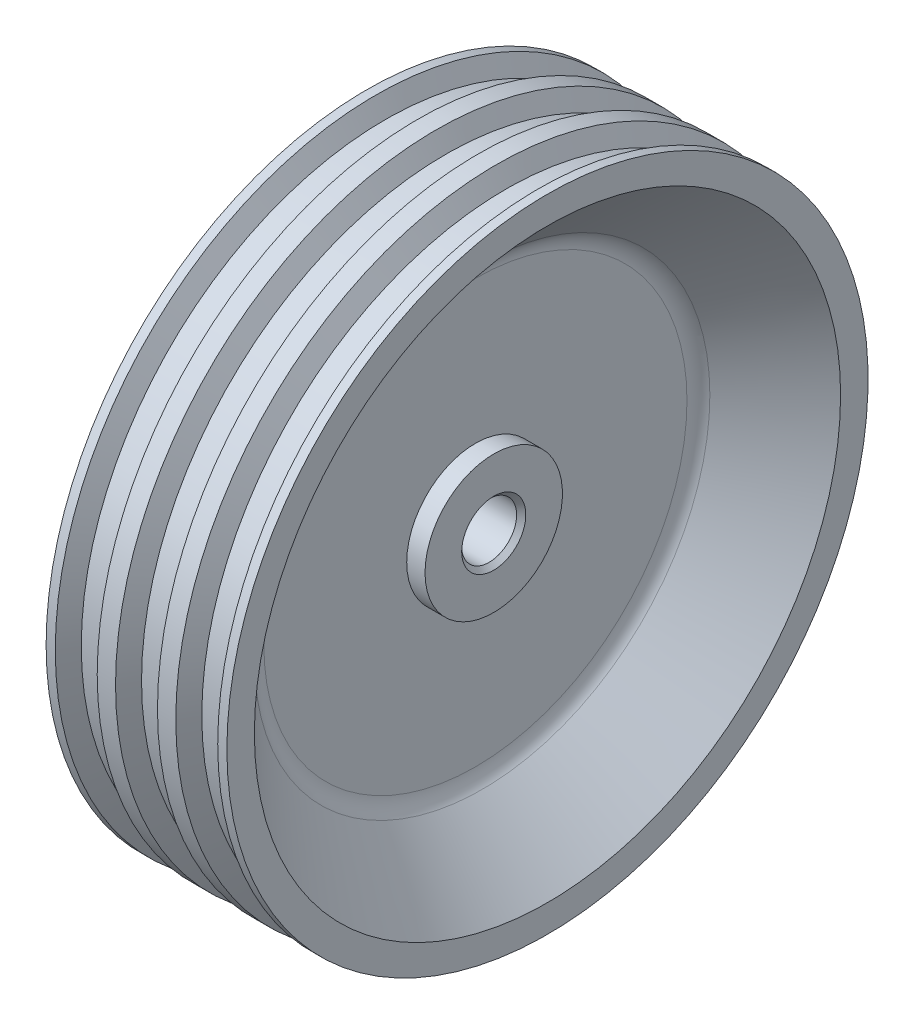
ISO-10303-21;
HEADER;
FILE_DESCRIPTION(('STEP AP214'),'2;1');
FILE_NAME('part.step','',(''),(''),'','','');
FILE_SCHEMA(('AUTOMOTIVE_DESIGN { 1 0 10303 214 1 1 1 1 }'));
ENDSEC;
DATA;
#1=APPLICATION_CONTEXT('core data for automotive mechanical design processes');
#2=APPLICATION_PROTOCOL_DEFINITION('international standard','automotive_design',2000,#1);
#3=PRODUCT_CONTEXT('',#1,'mechanical');
#4=PRODUCT('Part','Part','',(#3));
#5=PRODUCT_RELATED_PRODUCT_CATEGORY('part','',(#4));
#6=PRODUCT_DEFINITION_FORMATION('','',#4);
#7=PRODUCT_DEFINITION_CONTEXT('part definition',#1,'design');
#8=PRODUCT_DEFINITION('design','',#6,#7);
#9=PRODUCT_DEFINITION_SHAPE('','',#8);
#10=(LENGTH_UNIT() NAMED_UNIT(*) SI_UNIT(.MILLI.,.METRE.));
#11=(NAMED_UNIT(*) PLANE_ANGLE_UNIT() SI_UNIT($,.RADIAN.));
#12=(NAMED_UNIT(*) SI_UNIT($,.STERADIAN.) SOLID_ANGLE_UNIT());
#13=UNCERTAINTY_MEASURE_WITH_UNIT(LENGTH_MEASURE(1.E-05),#10,'distance_accuracy_value','');
#14=(GEOMETRIC_REPRESENTATION_CONTEXT(3) GLOBAL_UNCERTAINTY_ASSIGNED_CONTEXT((#13)) GLOBAL_UNIT_ASSIGNED_CONTEXT((#10,
#11,#12)) REPRESENTATION_CONTEXT('',''));
#15=CARTESIAN_POINT('',(0.,0.,0.));
#16=DIRECTION('',(0.,0.,1.));
#17=DIRECTION('',(1.,0.,0.));
#18=AXIS2_PLACEMENT_3D('',#15,#16,#17);
#19=CARTESIAN_POINT('',(8.,0.,0.));
#20=DIRECTION('',(-1.,0.,0.));
#21=DIRECTION('',(0.,0.,0.999999999999999));
#22=AXIS2_PLACEMENT_3D('',#19,#20,#21);
#23=PLANE('',#22);
#24=CARTESIAN_POINT('',(8.,0.,0.));
#25=DIRECTION('',(-1.,0.,0.));
#26=DIRECTION('',(0.,0.,0.999999999999999));
#27=AXIS2_PLACEMENT_3D('',#24,#25,#26);
#28=CIRCLE('',#27,7.00000000000001);
#29=CARTESIAN_POINT('',(8.,0.,7.));
#30=VERTEX_POINT('',#29);
#31=EDGE_CURVE('E12',#30,#30,#28,.T.);
#32=ORIENTED_EDGE('',*,*,#31,.T.);
#33=EDGE_LOOP('',(#32));
#34=FACE_BOUND('',#33,.T.);
#35=CARTESIAN_POINT('',(8.,0.,0.));
#36=DIRECTION('',(-1.,0.,0.));
#37=DIRECTION('',(0.,0.,0.999999999999999));
#38=AXIS2_PLACEMENT_3D('',#35,#36,#37);
#39=CIRCLE('',#38,15.);
#40=CARTESIAN_POINT('',(8.,0.,15.));
#41=VERTEX_POINT('',#40);
#42=EDGE_CURVE('E96',#41,#41,#39,.T.);
#43=ORIENTED_EDGE('',*,*,#42,.F.);
#44=EDGE_LOOP('',(#43));
#45=FACE_BOUND('',#44,.T.);
#46=ADVANCED_FACE('F55',(#34,#45),#23,.F.);
#47=CARTESIAN_POINT('',(-13.7579676272889,0.,0.));
#48=DIRECTION('',(-1.,0.,0.));
#49=DIRECTION('',(0.,0.,0.999999999999999));
#50=AXIS2_PLACEMENT_3D('',#47,#48,#49);
#51=CYLINDRICAL_SURFACE('',#50,15.);
#52=CARTESIAN_POINT('',(4.,0.,0.));
#53=DIRECTION('',(-1.,0.,0.));
#54=DIRECTION('',(0.,0.,0.999999999999999));
#55=AXIS2_PLACEMENT_3D('',#52,#53,#54);
#56=CIRCLE('',#55,15.);
#57=CARTESIAN_POINT('',(4.,0.,15.));
#58=VERTEX_POINT('',#57);
#59=EDGE_CURVE('E100',#58,#58,#56,.T.);
#60=ORIENTED_EDGE('',*,*,#59,.F.);
#61=EDGE_LOOP('',(#60));
#62=FACE_BOUND('',#61,.T.);
#63=ORIENTED_EDGE('',*,*,#42,.T.);
#64=EDGE_LOOP('',(#63));
#65=FACE_BOUND('',#64,.T.);
#66=ADVANCED_FACE('F197',(#62,#65),#51,.T.);
#67=CARTESIAN_POINT('',(4.,0.,-15.));
#68=DIRECTION('',(-1.,0.,0.));
#69=DIRECTION('',(0.,0.,0.999999999999999));
#70=AXIS2_PLACEMENT_3D('',#67,#68,#69);
#71=PLANE('',#70);
#72=CARTESIAN_POINT('',(4.,0.,0.));
#73=DIRECTION('',(-1.,0.,0.));
#74=DIRECTION('',(0.,0.,0.999999999999999));
#75=AXIS2_PLACEMENT_3D('',#72,#73,#74);
#76=CIRCLE('',#75,46.1935492808865);
#77=CARTESIAN_POINT('',(4.,0.,46.1935492808865));
#78=VERTEX_POINT('',#77);
#79=EDGE_CURVE('E88',#78,#78,#76,.F.);
#80=ORIENTED_EDGE('',*,*,#79,.T.);
#81=EDGE_LOOP('',(#80));
#82=FACE_BOUND('',#81,.T.);
#83=ORIENTED_EDGE('',*,*,#59,.T.);
#84=EDGE_LOOP('',(#83));
#85=FACE_BOUND('',#84,.T.);
#86=ADVANCED_FACE('F202',(#82,#85),#71,.F.);
#87=CARTESIAN_POINT('',(4.,0.,0.));
#88=DIRECTION('',(1.,0.,0.));
#89=DIRECTION('',(0.,0.,-0.999999999999999));
#90=AXIS2_PLACEMENT_3D('',#87,#88,#89);
#91=CONICAL_SURFACE('',#90,48.264617092752,0.785398163397451);
#92=CARTESIAN_POINT('',(5.46446609406725,0.,0.));
#93=DIRECTION('',(1.,0.,0.));
#94=DIRECTION('',(0.,0.,-0.999999999999999));
#95=AXIS2_PLACEMENT_3D('',#92,#93,#94);
#96=CIRCLE('',#95,49.7290831868192);
#97=CARTESIAN_POINT('',(5.46446609406725,0.,-49.7290831868192));
#98=VERTEX_POINT('',#97);
#99=EDGE_CURVE('E92',#98,#98,#96,.F.);
#100=ORIENTED_EDGE('',*,*,#99,.T.);
#101=EDGE_LOOP('',(#100));
#102=FACE_BOUND('',#101,.T.);
#103=CARTESIAN_POINT('',(19.735382907248,0.,0.));
#104=DIRECTION('',(-1.,0.,0.));
#105=DIRECTION('',(0.,0.,0.999999999999999));
#106=AXIS2_PLACEMENT_3D('',#103,#104,#105);
#107=CIRCLE('',#106,64.);
#108=CARTESIAN_POINT('',(19.735382907248,0.,64.));
#109=VERTEX_POINT('',#108);
#110=EDGE_CURVE('E104',#109,#109,#107,.T.);
#111=ORIENTED_EDGE('',*,*,#110,.F.);
#112=EDGE_LOOP('',(#111));
#113=FACE_BOUND('',#112,.T.);
#114=ADVANCED_FACE('F385',(#102,#113),#91,.F.);
#115=CARTESIAN_POINT('',(19.735382907248,0.,-64.));
#116=DIRECTION('',(-1.,0.,0.));
#117=DIRECTION('',(0.,0.,0.999999999999999));
#118=AXIS2_PLACEMENT_3D('',#115,#116,#117);
#119=PLANE('',#118);
#120=CARTESIAN_POINT('',(19.735382907248,0.,0.));
#121=DIRECTION('',(-1.,0.,0.));
#122=DIRECTION('',(0.,0.,0.999999999999999));
#123=AXIS2_PLACEMENT_3D('',#120,#121,#122);
#124=CIRCLE('',#123,70.);
#125=CARTESIAN_POINT('',(19.735382907248,0.,70.));
#126=VERTEX_POINT('',#125);
#127=EDGE_CURVE('E108',#126,#126,#124,.T.);
#128=ORIENTED_EDGE('',*,*,#127,.F.);
#129=EDGE_LOOP('',(#128));
#130=FACE_BOUND('',#129,.T.);
#131=ORIENTED_EDGE('',*,*,#110,.T.);
#132=EDGE_LOOP('',(#131));
#133=FACE_BOUND('',#132,.T.);
#134=ADVANCED_FACE('F377',(#130,#133),#119,.F.);
#135=CARTESIAN_POINT('',(-13.7579676272889,0.,0.));
#136=DIRECTION('',(-1.,0.,0.));
#137=DIRECTION('',(0.,0.,0.999999999999999));
#138=AXIS2_PLACEMENT_3D('',#135,#136,#137);
#139=CYLINDRICAL_SURFACE('',#138,70.);
#140=CARTESIAN_POINT('',(17.735382907248,0.,0.));
#141=DIRECTION('',(-1.,0.,0.));
#142=DIRECTION('',(0.,0.,0.999999999999999));
#143=AXIS2_PLACEMENT_3D('',#140,#141,#142);
#144=CIRCLE('',#143,70.);
#145=CARTESIAN_POINT('',(17.735382907248,0.,70.));
#146=VERTEX_POINT('',#145);
#147=EDGE_CURVE('E112',#146,#146,#144,.T.);
#148=ORIENTED_EDGE('',*,*,#147,.F.);
#149=EDGE_LOOP('',(#148));
#150=FACE_BOUND('',#149,.T.);
#151=ORIENTED_EDGE('',*,*,#127,.T.);
#152=EDGE_LOOP('',(#151));
#153=FACE_BOUND('',#152,.T.);
#154=ADVANCED_FACE('F369',(#150,#153),#139,.T.);
#155=CARTESIAN_POINT('',(17.735382907248,0.,0.));
#156=DIRECTION('',(1.,0.,0.));
#157=DIRECTION('',(0.,0.,-0.999999999999999));
#158=AXIS2_PLACEMENT_3D('',#155,#156,#157);
#159=CONICAL_SURFACE('',#158,70.,1.0471975511966);
#160=CARTESIAN_POINT('',(15.6569219381653,0.,0.));
#161=DIRECTION('',(-1.,0.,0.));
#162=DIRECTION('',(0.,0.,0.999999999999999));
#163=AXIS2_PLACEMENT_3D('',#160,#161,#162);
#164=CIRCLE('',#163,66.4);
#165=CARTESIAN_POINT('',(15.6569219381653,0.,66.4));
#166=VERTEX_POINT('',#165);
#167=EDGE_CURVE('E116',#166,#166,#164,.T.);
#168=ORIENTED_EDGE('',*,*,#167,.F.);
#169=EDGE_LOOP('',(#168));
#170=FACE_BOUND('',#169,.T.);
#171=ORIENTED_EDGE('',*,*,#147,.T.);
#172=EDGE_LOOP('',(#171));
#173=FACE_BOUND('',#172,.T.);
#174=ADVANCED_FACE('F361',(#170,#173),#159,.T.);
#175=CARTESIAN_POINT('',(-13.7579676272889,0.,0.));
#176=DIRECTION('',(-1.,0.,0.));
#177=DIRECTION('',(0.,0.,0.999999999999999));
#178=AXIS2_PLACEMENT_3D('',#175,#176,#177);
#179=CYLINDRICAL_SURFACE('',#178,66.4);
#180=CARTESIAN_POINT('',(10.6569219381653,0.,0.));
#181=DIRECTION('',(-1.,0.,0.));
#182=DIRECTION('',(0.,0.,0.999999999999999));
#183=AXIS2_PLACEMENT_3D('',#180,#181,#182);
#184=CIRCLE('',#183,66.4);
#185=CARTESIAN_POINT('',(10.6569219381653,0.,66.4));
#186=VERTEX_POINT('',#185);
#187=EDGE_CURVE('E120',#186,#186,#184,.T.);
#188=ORIENTED_EDGE('',*,*,#187,.F.);
#189=EDGE_LOOP('',(#188));
#190=FACE_BOUND('',#189,.T.);
#191=ORIENTED_EDGE('',*,*,#167,.T.);
#192=EDGE_LOOP('',(#191));
#193=FACE_BOUND('',#192,.T.);
#194=ADVANCED_FACE('F353',(#190,#193),#179,.T.);
#195=CARTESIAN_POINT('',(10.6569219381653,0.,0.));
#196=DIRECTION('',(-1.,0.,0.));
#197=DIRECTION('',(0.,0.,0.999999999999999));
#198=AXIS2_PLACEMENT_3D('',#195,#196,#197);
#199=CONICAL_SURFACE('',#198,66.4,1.0471975511966);
#200=CARTESIAN_POINT('',(8.57846096908266,0.,0.));
#201=DIRECTION('',(-1.,0.,0.));
#202=DIRECTION('',(0.,0.,0.999999999999999));
#203=AXIS2_PLACEMENT_3D('',#200,#201,#202);
#204=CIRCLE('',#203,70.);
#205=CARTESIAN_POINT('',(8.57846096908266,0.,70.));
#206=VERTEX_POINT('',#205);
#207=EDGE_CURVE('E124',#206,#206,#204,.T.);
#208=ORIENTED_EDGE('',*,*,#207,.F.);
#209=EDGE_LOOP('',(#208));
#210=FACE_BOUND('',#209,.T.);
#211=ORIENTED_EDGE('',*,*,#187,.T.);
#212=EDGE_LOOP('',(#211));
#213=FACE_BOUND('',#212,.T.);
#214=ADVANCED_FACE('F345',(#210,#213),#199,.T.);
#215=CARTESIAN_POINT('',(-13.7579676272889,0.,0.));
#216=DIRECTION('',(-1.,0.,0.));
#217=DIRECTION('',(0.,0.,0.999999999999999));
#218=AXIS2_PLACEMENT_3D('',#215,#216,#217);
#219=CYLINDRICAL_SURFACE('',#218,70.);
#220=CARTESIAN_POINT('',(4.57846096908265,0.,0.));
#221=DIRECTION('',(-1.,0.,0.));
#222=DIRECTION('',(0.,0.,0.999999999999999));
#223=AXIS2_PLACEMENT_3D('',#220,#221,#222);
#224=CIRCLE('',#223,70.);
#225=CARTESIAN_POINT('',(4.57846096908265,0.,70.));
#226=VERTEX_POINT('',#225);
#227=EDGE_CURVE('E128',#226,#226,#224,.T.);
#228=ORIENTED_EDGE('',*,*,#227,.F.);
#229=EDGE_LOOP('',(#228));
#230=FACE_BOUND('',#229,.T.);
#231=ORIENTED_EDGE('',*,*,#207,.T.);
#232=EDGE_LOOP('',(#231));
#233=FACE_BOUND('',#232,.T.);
#234=ADVANCED_FACE('F337',(#230,#233),#219,.T.);
#235=CARTESIAN_POINT('',(4.57846096908265,0.,0.));
#236=DIRECTION('',(1.,0.,0.));
#237=DIRECTION('',(0.,0.,-0.999999999999999));
#238=AXIS2_PLACEMENT_3D('',#235,#236,#237);
#239=CONICAL_SURFACE('',#238,70.,1.0471975511966);
#240=CARTESIAN_POINT('',(2.5,0.,0.));
#241=DIRECTION('',(-1.,0.,0.));
#242=DIRECTION('',(0.,0.,0.999999999999999));
#243=AXIS2_PLACEMENT_3D('',#240,#241,#242);
#244=CIRCLE('',#243,66.4);
#245=CARTESIAN_POINT('',(2.5,0.,66.4));
#246=VERTEX_POINT('',#245);
#247=EDGE_CURVE('E132',#246,#246,#244,.T.);
#248=ORIENTED_EDGE('',*,*,#247,.F.);
#249=EDGE_LOOP('',(#248));
#250=FACE_BOUND('',#249,.T.);
#251=ORIENTED_EDGE('',*,*,#227,.T.);
#252=EDGE_LOOP('',(#251));
#253=FACE_BOUND('',#252,.T.);
#254=ADVANCED_FACE('F329',(#250,#253),#239,.T.);
#255=CARTESIAN_POINT('',(-13.7579676272889,0.,0.));
#256=DIRECTION('',(-1.,0.,0.));
#257=DIRECTION('',(0.,0.,0.999999999999999));
#258=AXIS2_PLACEMENT_3D('',#255,#256,#257);
#259=CYLINDRICAL_SURFACE('',#258,66.4);
#260=CARTESIAN_POINT('',(-2.5,0.,0.));
#261=DIRECTION('',(-1.,0.,0.));
#262=DIRECTION('',(0.,0.,0.999999999999999));
#263=AXIS2_PLACEMENT_3D('',#260,#261,#262);
#264=CIRCLE('',#263,66.4);
#265=CARTESIAN_POINT('',(-2.5,0.,66.4));
#266=VERTEX_POINT('',#265);
#267=EDGE_CURVE('E136',#266,#266,#264,.T.);
#268=ORIENTED_EDGE('',*,*,#267,.F.);
#269=EDGE_LOOP('',(#268));
#270=FACE_BOUND('',#269,.T.);
#271=ORIENTED_EDGE('',*,*,#247,.T.);
#272=EDGE_LOOP('',(#271));
#273=FACE_BOUND('',#272,.T.);
#274=ADVANCED_FACE('F321',(#270,#273),#259,.T.);
#275=CARTESIAN_POINT('',(-2.5,0.,0.));
#276=DIRECTION('',(-1.,0.,0.));
#277=DIRECTION('',(0.,0.,0.999999999999999));
#278=AXIS2_PLACEMENT_3D('',#275,#276,#277);
#279=CONICAL_SURFACE('',#278,66.4,1.0471975511966);
#280=CARTESIAN_POINT('',(-4.57846096908265,0.,0.));
#281=DIRECTION('',(-1.,0.,0.));
#282=DIRECTION('',(0.,0.,0.999999999999999));
#283=AXIS2_PLACEMENT_3D('',#280,#281,#282);
#284=CIRCLE('',#283,70.);
#285=CARTESIAN_POINT('',(-4.57846096908265,0.,70.));
#286=VERTEX_POINT('',#285);
#287=EDGE_CURVE('E140',#286,#286,#284,.T.);
#288=ORIENTED_EDGE('',*,*,#287,.F.);
#289=EDGE_LOOP('',(#288));
#290=FACE_BOUND('',#289,.T.);
#291=ORIENTED_EDGE('',*,*,#267,.T.);
#292=EDGE_LOOP('',(#291));
#293=FACE_BOUND('',#292,.T.);
#294=ADVANCED_FACE('F313',(#290,#293),#279,.T.);
#295=CARTESIAN_POINT('',(-13.7579676272889,0.,0.));
#296=DIRECTION('',(-1.,0.,0.));
#297=DIRECTION('',(0.,0.,0.999999999999999));
#298=AXIS2_PLACEMENT_3D('',#295,#296,#297);
#299=CYLINDRICAL_SURFACE('',#298,70.);
#300=CARTESIAN_POINT('',(-8.57846096908266,0.,0.));
#301=DIRECTION('',(-1.,0.,0.));
#302=DIRECTION('',(0.,0.,0.999999999999999));
#303=AXIS2_PLACEMENT_3D('',#300,#301,#302);
#304=CIRCLE('',#303,70.);
#305=CARTESIAN_POINT('',(-8.57846096908266,0.,70.));
#306=VERTEX_POINT('',#305);
#307=EDGE_CURVE('E144',#306,#306,#304,.T.);
#308=ORIENTED_EDGE('',*,*,#307,.F.);
#309=EDGE_LOOP('',(#308));
#310=FACE_BOUND('',#309,.T.);
#311=ORIENTED_EDGE('',*,*,#287,.T.);
#312=EDGE_LOOP('',(#311));
#313=FACE_BOUND('',#312,.T.);
#314=ADVANCED_FACE('F305',(#310,#313),#299,.T.);
#315=CARTESIAN_POINT('',(-8.57846096908266,0.,0.));
#316=DIRECTION('',(1.,0.,0.));
#317=DIRECTION('',(0.,0.,-0.999999999999999));
#318=AXIS2_PLACEMENT_3D('',#315,#316,#317);
#319=CONICAL_SURFACE('',#318,70.,1.0471975511966);
#320=CARTESIAN_POINT('',(-10.6569219381653,0.,0.));
#321=DIRECTION('',(-1.,0.,0.));
#322=DIRECTION('',(0.,0.,0.999999999999999));
#323=AXIS2_PLACEMENT_3D('',#320,#321,#322);
#324=CIRCLE('',#323,66.4);
#325=CARTESIAN_POINT('',(-10.6569219381653,0.,66.4));
#326=VERTEX_POINT('',#325);
#327=EDGE_CURVE('E148',#326,#326,#324,.T.);
#328=ORIENTED_EDGE('',*,*,#327,.F.);
#329=EDGE_LOOP('',(#328));
#330=FACE_BOUND('',#329,.T.);
#331=ORIENTED_EDGE('',*,*,#307,.T.);
#332=EDGE_LOOP('',(#331));
#333=FACE_BOUND('',#332,.T.);
#334=ADVANCED_FACE('F297',(#330,#333),#319,.T.);
#335=CARTESIAN_POINT('',(-13.7579676272889,0.,0.));
#336=DIRECTION('',(-1.,0.,0.));
#337=DIRECTION('',(0.,0.,0.999999999999999));
#338=AXIS2_PLACEMENT_3D('',#335,#336,#337);
#339=CYLINDRICAL_SURFACE('',#338,66.4);
#340=CARTESIAN_POINT('',(-15.6569219381653,0.,0.));
#341=DIRECTION('',(-1.,0.,0.));
#342=DIRECTION('',(0.,0.,0.999999999999999));
#343=AXIS2_PLACEMENT_3D('',#340,#341,#342);
#344=CIRCLE('',#343,66.4);
#345=CARTESIAN_POINT('',(-15.6569219381653,0.,66.4));
#346=VERTEX_POINT('',#345);
#347=EDGE_CURVE('E152',#346,#346,#344,.T.);
#348=ORIENTED_EDGE('',*,*,#347,.F.);
#349=EDGE_LOOP('',(#348));
#350=FACE_BOUND('',#349,.T.);
#351=ORIENTED_EDGE('',*,*,#327,.T.);
#352=EDGE_LOOP('',(#351));
#353=FACE_BOUND('',#352,.T.);
#354=ADVANCED_FACE('F289',(#350,#353),#339,.T.);
#355=CARTESIAN_POINT('',(-15.6569219381653,0.,0.));
#356=DIRECTION('',(-1.,0.,0.));
#357=DIRECTION('',(0.,0.,0.999999999999999));
#358=AXIS2_PLACEMENT_3D('',#355,#356,#357);
#359=CONICAL_SURFACE('',#358,66.4,1.0471975511966);
#360=CARTESIAN_POINT('',(-17.735382907248,0.,0.));
#361=DIRECTION('',(-1.,0.,0.));
#362=DIRECTION('',(0.,0.,0.999999999999999));
#363=AXIS2_PLACEMENT_3D('',#360,#361,#362);
#364=CIRCLE('',#363,70.);
#365=CARTESIAN_POINT('',(-17.735382907248,0.,70.));
#366=VERTEX_POINT('',#365);
#367=EDGE_CURVE('E156',#366,#366,#364,.T.);
#368=ORIENTED_EDGE('',*,*,#367,.F.);
#369=EDGE_LOOP('',(#368));
#370=FACE_BOUND('',#369,.T.);
#371=ORIENTED_EDGE('',*,*,#347,.T.);
#372=EDGE_LOOP('',(#371));
#373=FACE_BOUND('',#372,.T.);
#374=ADVANCED_FACE('F281',(#370,#373),#359,.T.);
#375=CARTESIAN_POINT('',(-13.7579676272889,0.,0.));
#376=DIRECTION('',(-1.,0.,0.));
#377=DIRECTION('',(0.,0.,0.999999999999999));
#378=AXIS2_PLACEMENT_3D('',#375,#376,#377);
#379=CYLINDRICAL_SURFACE('',#378,70.);
#380=CARTESIAN_POINT('',(-19.735382907248,0.,0.));
#381=DIRECTION('',(-1.,0.,0.));
#382=DIRECTION('',(0.,0.,0.999999999999999));
#383=AXIS2_PLACEMENT_3D('',#380,#381,#382);
#384=CIRCLE('',#383,70.);
#385=CARTESIAN_POINT('',(-19.735382907248,0.,70.));
#386=VERTEX_POINT('',#385);
#387=EDGE_CURVE('E160',#386,#386,#384,.T.);
#388=ORIENTED_EDGE('',*,*,#387,.F.);
#389=EDGE_LOOP('',(#388));
#390=FACE_BOUND('',#389,.T.);
#391=ORIENTED_EDGE('',*,*,#367,.T.);
#392=EDGE_LOOP('',(#391));
#393=FACE_BOUND('',#392,.T.);
#394=ADVANCED_FACE('F273',(#390,#393),#379,.T.);
#395=CARTESIAN_POINT('',(-19.735382907248,0.,-64.));
#396=DIRECTION('',(1.,0.,0.));
#397=DIRECTION('',(0.,0.,-0.999999999999999));
#398=AXIS2_PLACEMENT_3D('',#395,#396,#397);
#399=PLANE('',#398);
#400=CARTESIAN_POINT('',(-19.735382907248,0.,0.));
#401=DIRECTION('',(-1.,0.,0.));
#402=DIRECTION('',(0.,0.,0.999999999999999));
#403=AXIS2_PLACEMENT_3D('',#400,#401,#402);
#404=CIRCLE('',#403,64.);
#405=CARTESIAN_POINT('',(-19.735382907248,0.,64.));
#406=VERTEX_POINT('',#405);
#407=EDGE_CURVE('E164',#406,#406,#404,.T.);
#408=ORIENTED_EDGE('',*,*,#407,.F.);
#409=EDGE_LOOP('',(#408));
#410=FACE_BOUND('',#409,.T.);
#411=ORIENTED_EDGE('',*,*,#387,.T.);
#412=EDGE_LOOP('',(#411));
#413=FACE_BOUND('',#412,.T.);
#414=ADVANCED_FACE('F193',(#410,#413),#399,.F.);
#415=CARTESIAN_POINT('',(-19.735382907248,0.,0.));
#416=DIRECTION('',(-1.,0.,0.));
#417=DIRECTION('',(0.,0.,0.999999999999999));
#418=AXIS2_PLACEMENT_3D('',#415,#416,#417);
#419=CONICAL_SURFACE('',#418,64.,0.785398163397451);
#420=CARTESIAN_POINT('',(-5.46446609406725,0.,0.));
#421=DIRECTION('',(-1.,0.,0.));
#422=DIRECTION('',(0.,0.,0.999999999999999));
#423=AXIS2_PLACEMENT_3D('',#420,#421,#422);
#424=CIRCLE('',#423,49.7290831868192);
#425=CARTESIAN_POINT('',(-5.46446609406725,0.,49.7290831868192));
#426=VERTEX_POINT('',#425);
#427=EDGE_CURVE('E80',#426,#426,#424,.F.);
#428=ORIENTED_EDGE('',*,*,#427,.T.);
#429=EDGE_LOOP('',(#428));
#430=FACE_BOUND('',#429,.T.);
#431=ORIENTED_EDGE('',*,*,#407,.T.);
#432=EDGE_LOOP('',(#431));
#433=FACE_BOUND('',#432,.T.);
#434=ADVANCED_FACE('F187',(#430,#433),#419,.F.);
#435=CARTESIAN_POINT('',(-4.,0.,-15.));
#436=DIRECTION('',(1.,0.,0.));
#437=DIRECTION('',(0.,0.,-0.999999999999999));
#438=AXIS2_PLACEMENT_3D('',#435,#436,#437);
#439=PLANE('',#438);
#440=CARTESIAN_POINT('',(-4.,0.,0.));
#441=DIRECTION('',(1.,0.,0.));
#442=DIRECTION('',(0.,0.,-0.999999999999999));
#443=AXIS2_PLACEMENT_3D('',#440,#441,#442);
#444=CIRCLE('',#443,46.1935492808865);
#445=CARTESIAN_POINT('',(-4.,0.,-46.1935492808865));
#446=VERTEX_POINT('',#445);
#447=EDGE_CURVE('E84',#446,#446,#444,.F.);
#448=ORIENTED_EDGE('',*,*,#447,.T.);
#449=EDGE_LOOP('',(#448));
#450=FACE_BOUND('',#449,.T.);
#451=CARTESIAN_POINT('',(-4.,0.,0.));
#452=DIRECTION('',(-1.,0.,0.));
#453=DIRECTION('',(0.,0.,0.999999999999999));
#454=AXIS2_PLACEMENT_3D('',#451,#452,#453);
#455=CIRCLE('',#454,15.);
#456=CARTESIAN_POINT('',(-4.,0.,15.));
#457=VERTEX_POINT('',#456);
#458=EDGE_CURVE('E168',#457,#457,#455,.T.);
#459=ORIENTED_EDGE('',*,*,#458,.F.);
#460=EDGE_LOOP('',(#459));
#461=FACE_BOUND('',#460,.T.);
#462=ADVANCED_FACE('F182',(#450,#461),#439,.F.);
#463=CARTESIAN_POINT('',(-13.7579676272889,0.,0.));
#464=DIRECTION('',(-1.,0.,0.));
#465=DIRECTION('',(0.,0.,0.999999999999999));
#466=AXIS2_PLACEMENT_3D('',#463,#464,#465);
#467=CYLINDRICAL_SURFACE('',#466,15.);
#468=CARTESIAN_POINT('',(-8.,0.,0.));
#469=DIRECTION('',(-1.,0.,0.));
#470=DIRECTION('',(0.,0.,0.999999999999999));
#471=AXIS2_PLACEMENT_3D('',#468,#469,#470);
#472=CIRCLE('',#471,15.);
#473=CARTESIAN_POINT('',(-8.,0.,15.));
#474=VERTEX_POINT('',#473);
#475=EDGE_CURVE('E172',#474,#474,#472,.T.);
#476=ORIENTED_EDGE('',*,*,#475,.F.);
#477=EDGE_LOOP('',(#476));
#478=FACE_BOUND('',#477,.T.);
#479=ORIENTED_EDGE('',*,*,#458,.T.);
#480=EDGE_LOOP('',(#479));
#481=FACE_BOUND('',#480,.T.);
#482=ADVANCED_FACE('F179',(#478,#481),#467,.T.);
#483=CARTESIAN_POINT('',(-8.,0.,0.));
#484=DIRECTION('',(1.,0.,0.));
#485=DIRECTION('',(0.,0.,-0.999999999999999));
#486=AXIS2_PLACEMENT_3D('',#483,#484,#485);
#487=PLANE('',#486);
#488=CARTESIAN_POINT('',(-8.,0.,0.));
#489=DIRECTION('',(1.,0.,0.));
#490=DIRECTION('',(0.,0.,-0.999999999999999));
#491=AXIS2_PLACEMENT_3D('',#488,#489,#490);
#492=CIRCLE('',#491,7.00000000000003);
#493=CARTESIAN_POINT('',(-8.,0.,-7.00000000000003));
#494=VERTEX_POINT('',#493);
#495=EDGE_CURVE('E74',#494,#494,#492,.T.);
#496=ORIENTED_EDGE('',*,*,#495,.T.);
#497=EDGE_LOOP('',(#496));
#498=FACE_BOUND('',#497,.T.);
#499=ORIENTED_EDGE('',*,*,#475,.T.);
#500=EDGE_LOOP('',(#499));
#501=FACE_BOUND('',#500,.T.);
#502=ADVANCED_FACE('F177',(#498,#501),#487,.F.);
#503=CARTESIAN_POINT('',(8.,0.,0.));
#504=DIRECTION('',(1.,0.,0.));
#505=DIRECTION('',(0.,0.,-0.999999999999999));
#506=AXIS2_PLACEMENT_3D('',#503,#504,#505);
#507=CYLINDRICAL_SURFACE('',#506,6.);
#508=CARTESIAN_POINT('',(-6.99999999999996,0.,0.));
#509=DIRECTION('',(1.,0.,0.));
#510=DIRECTION('',(0.,0.,-0.999999999999999));
#511=AXIS2_PLACEMENT_3D('',#508,#509,#510);
#512=CIRCLE('',#511,6.);
#513=CARTESIAN_POINT('',(-6.99999999999996,0.,-5.99999999999999));
#514=VERTEX_POINT('',#513);
#515=EDGE_CURVE('E64',#514,#514,#512,.F.);
#516=ORIENTED_EDGE('',*,*,#515,.T.);
#517=EDGE_LOOP('',(#516));
#518=FACE_BOUND('',#517,.T.);
#519=CARTESIAN_POINT('',(7.,0.,0.));
#520=DIRECTION('',(-1.,0.,0.));
#521=DIRECTION('',(0.,0.,0.999999999999999));
#522=AXIS2_PLACEMENT_3D('',#519,#520,#521);
#523=CIRCLE('',#522,6.);
#524=CARTESIAN_POINT('',(7.,0.,5.99999999999999));
#525=VERTEX_POINT('',#524);
#526=EDGE_CURVE('E69',#525,#525,#523,.F.);
#527=ORIENTED_EDGE('',*,*,#526,.T.);
#528=EDGE_LOOP('',(#527));
#529=FACE_BOUND('',#528,.T.);
#530=ADVANCED_FACE('F212',(#518,#529),#507,.F.);
#531=CARTESIAN_POINT('',(9.,0.,0.));
#532=DIRECTION('',(-1.,0.,0.));
#533=DIRECTION('',(0.,0.,0.999999999999999));
#534=AXIS2_PLACEMENT_3D('',#531,#532,#533);
#535=TOROIDAL_SURFACE('',#534,46.1935492808865,5.);
#536=ORIENTED_EDGE('',*,*,#79,.F.);
#537=EDGE_LOOP('',(#536));
#538=FACE_BOUND('',#537,.T.);
#539=ORIENTED_EDGE('',*,*,#99,.F.);
#540=EDGE_LOOP('',(#539));
#541=FACE_BOUND('',#540,.T.);
#542=ADVANCED_FACE('F208',(#538,#541),#535,.F.);
#543=CARTESIAN_POINT('',(-9.,0.,0.));
#544=DIRECTION('',(1.,0.,0.));
#545=DIRECTION('',(0.,0.,-0.999999999999999));
#546=AXIS2_PLACEMENT_3D('',#543,#544,#545);
#547=TOROIDAL_SURFACE('',#546,46.1935492808865,5.);
#548=ORIENTED_EDGE('',*,*,#427,.F.);
#549=EDGE_LOOP('',(#548));
#550=FACE_BOUND('',#549,.T.);
#551=ORIENTED_EDGE('',*,*,#447,.F.);
#552=EDGE_LOOP('',(#551));
#553=FACE_BOUND('',#552,.T.);
#554=ADVANCED_FACE('F211',(#550,#553),#547,.F.);
#555=CARTESIAN_POINT('',(-8.,0.,0.));
#556=DIRECTION('',(-1.,0.,0.));
#557=DIRECTION('',(0.,0.,0.999999999999999));
#558=AXIS2_PLACEMENT_3D('',#555,#556,#557);
#559=CONICAL_SURFACE('',#558,7.00000000000003,0.785398163397445);
#560=ORIENTED_EDGE('',*,*,#515,.F.);
#561=EDGE_LOOP('',(#560));
#562=FACE_BOUND('',#561,.T.);
#563=ORIENTED_EDGE('',*,*,#495,.F.);
#564=EDGE_LOOP('',(#563));
#565=FACE_BOUND('',#564,.T.);
#566=ADVANCED_FACE('F215',(#562,#565),#559,.F.);
#567=CARTESIAN_POINT('',(7.,0.,0.));
#568=DIRECTION('',(1.,0.,0.));
#569=DIRECTION('',(0.,0.,-0.999999999999999));
#570=AXIS2_PLACEMENT_3D('',#567,#568,#569);
#571=CONICAL_SURFACE('',#570,6.,0.785398163397452);
#572=ORIENTED_EDGE('',*,*,#31,.F.);
#573=EDGE_LOOP('',(#572));
#574=FACE_BOUND('',#573,.T.);
#575=ORIENTED_EDGE('',*,*,#526,.F.);
#576=EDGE_LOOP('',(#575));
#577=FACE_BOUND('',#576,.T.);
#578=ADVANCED_FACE('F58',(#574,#577),#571,.F.);
#579=CLOSED_SHELL('',(#46,#66,#86,#114,#134,#154,#174,#194,#214,#234,#254,#274,#294,#314,#334,
#354,#374,#394,#414,#434,#462,#482,#502,#530,#542,#554,#566,#578));
#580=MANIFOLD_SOLID_BREP('B2',#579);
#581=ADVANCED_BREP_SHAPE_REPRESENTATION('',(#18,#580),#14);
#582=SHAPE_DEFINITION_REPRESENTATION(#9,#581);
ENDSEC;
END-ISO-10303-21;
